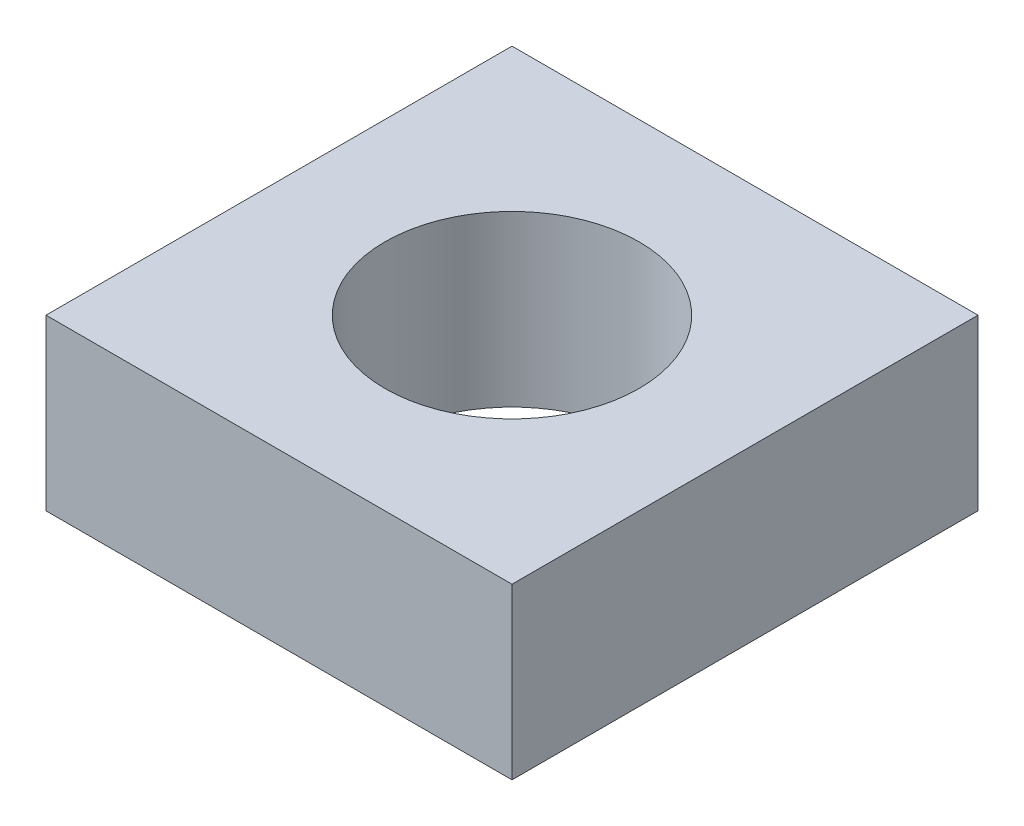
ISO-10303-21;
HEADER;
FILE_DESCRIPTION(('STEP AP214'),'2;1');
FILE_NAME('part.step','',(''),(''),'','','');
FILE_SCHEMA(('AUTOMOTIVE_DESIGN { 1 0 10303 214 1 1 1 1 }'));
ENDSEC;
DATA;
#1=APPLICATION_CONTEXT('core data for automotive mechanical design processes');
#2=APPLICATION_PROTOCOL_DEFINITION('international standard','automotive_design',2000,#1);
#3=PRODUCT_CONTEXT('',#1,'mechanical');
#4=PRODUCT('Part','Part','',(#3));
#5=PRODUCT_RELATED_PRODUCT_CATEGORY('part','',(#4));
#6=PRODUCT_DEFINITION_FORMATION('','',#4);
#7=PRODUCT_DEFINITION_CONTEXT('part definition',#1,'design');
#8=PRODUCT_DEFINITION('design','',#6,#7);
#9=PRODUCT_DEFINITION_SHAPE('','',#8);
#10=(LENGTH_UNIT() NAMED_UNIT(*) SI_UNIT(.MILLI.,.METRE.));
#11=(NAMED_UNIT(*) PLANE_ANGLE_UNIT() SI_UNIT($,.RADIAN.));
#12=(NAMED_UNIT(*) SI_UNIT($,.STERADIAN.) SOLID_ANGLE_UNIT());
#13=UNCERTAINTY_MEASURE_WITH_UNIT(LENGTH_MEASURE(1.E-05),#10,'distance_accuracy_value','');
#14=(GEOMETRIC_REPRESENTATION_CONTEXT(3) GLOBAL_UNCERTAINTY_ASSIGNED_CONTEXT((#13)) GLOBAL_UNIT_ASSIGNED_CONTEXT((#10,
#11,#12)) REPRESENTATION_CONTEXT('',''));
#15=CARTESIAN_POINT('',(0.,0.,0.));
#16=DIRECTION('',(0.,0.,1.));
#17=DIRECTION('',(1.,0.,0.));
#18=AXIS2_PLACEMENT_3D('',#15,#16,#17);
#19=CARTESIAN_POINT('',(2.75,2.,-2.75));
#20=DIRECTION('',(-1.,0.,0.));
#21=DIRECTION('',(0.,0.,1.));
#22=AXIS2_PLACEMENT_3D('',#19,#20,#21);
#23=PLANE('',#22);
#24=DIRECTION('',(0.,0.,-1.));
#25=VECTOR('',#24,1.);
#26=CARTESIAN_POINT('',(2.75,0.,-2.75));
#27=LINE('',#26,#25);
#28=CARTESIAN_POINT('',(2.75,0.,2.75));
#29=VERTEX_POINT('',#28);
#30=CARTESIAN_POINT('',(2.75,0.,-2.75));
#31=VERTEX_POINT('',#30);
#32=EDGE_CURVE('E107',#29,#31,#27,.T.);
#33=ORIENTED_EDGE('',*,*,#32,.T.);
#34=DIRECTION('',(0.,-1.,0.));
#35=VECTOR('',#34,1.);
#36=CARTESIAN_POINT('',(2.75,2.,-2.75));
#37=LINE('',#36,#35);
#38=CARTESIAN_POINT('',(2.75,2.,-2.75));
#39=VERTEX_POINT('',#38);
#40=EDGE_CURVE('E11',#39,#31,#37,.T.);
#41=ORIENTED_EDGE('',*,*,#40,.F.);
#42=DIRECTION('',(0.,0.,-1.));
#43=VECTOR('',#42,1.);
#44=CARTESIAN_POINT('',(2.75,2.,-2.75));
#45=LINE('',#44,#43);
#46=CARTESIAN_POINT('',(2.75,2.,2.75));
#47=VERTEX_POINT('',#46);
#48=EDGE_CURVE('E91',#47,#39,#45,.T.);
#49=ORIENTED_EDGE('',*,*,#48,.F.);
#50=DIRECTION('',(0.,-1.,0.));
#51=VECTOR('',#50,1.);
#52=CARTESIAN_POINT('',(2.75,2.,2.75));
#53=LINE('',#52,#51);
#54=EDGE_CURVE('E103',#47,#29,#53,.T.);
#55=ORIENTED_EDGE('',*,*,#54,.T.);
#56=EDGE_LOOP('',(#33,#41,#49,#55));
#57=FACE_BOUND('',#56,.T.);
#58=ADVANCED_FACE('F39',(#57),#23,.F.);
#59=CARTESIAN_POINT('',(-2.75,2.,-2.75));
#60=DIRECTION('',(0.,0.,1.));
#61=DIRECTION('',(1.,0.,0.));
#62=AXIS2_PLACEMENT_3D('',#59,#60,#61);
#63=PLANE('',#62);
#64=DIRECTION('',(-1.,0.,0.));
#65=VECTOR('',#64,1.);
#66=CARTESIAN_POINT('',(-2.75,0.,-2.75));
#67=LINE('',#66,#65);
#68=CARTESIAN_POINT('',(-2.75,0.,-2.75));
#69=VERTEX_POINT('',#68);
#70=EDGE_CURVE('E96',#31,#69,#67,.T.);
#71=ORIENTED_EDGE('',*,*,#70,.T.);
#72=DIRECTION('',(0.,-1.,0.));
#73=VECTOR('',#72,1.);
#74=CARTESIAN_POINT('',(-2.75,2.,-2.75));
#75=LINE('',#74,#73);
#76=CARTESIAN_POINT('',(-2.75,2.,-2.75));
#77=VERTEX_POINT('',#76);
#78=EDGE_CURVE('E48',#77,#69,#75,.T.);
#79=ORIENTED_EDGE('',*,*,#78,.F.);
#80=DIRECTION('',(-1.,0.,0.));
#81=VECTOR('',#80,1.);
#82=CARTESIAN_POINT('',(-2.75,2.,-2.75));
#83=LINE('',#82,#81);
#84=EDGE_CURVE('E86',#39,#77,#83,.T.);
#85=ORIENTED_EDGE('',*,*,#84,.F.);
#86=ORIENTED_EDGE('',*,*,#40,.T.);
#87=EDGE_LOOP('',(#71,#79,#85,#86));
#88=FACE_BOUND('',#87,.T.);
#89=ADVANCED_FACE('F95',(#88),#63,.F.);
#90=CARTESIAN_POINT('',(-2.75,2.,-2.75));
#91=DIRECTION('',(1.,0.,0.));
#92=DIRECTION('',(0.,0.,-1.));
#93=AXIS2_PLACEMENT_3D('',#90,#91,#92);
#94=PLANE('',#93);
#95=DIRECTION('',(0.,0.,1.));
#96=VECTOR('',#95,1.);
#97=CARTESIAN_POINT('',(-2.75,0.,-2.75));
#98=LINE('',#97,#96);
#99=CARTESIAN_POINT('',(-2.75,0.,2.75));
#100=VERTEX_POINT('',#99);
#101=EDGE_CURVE('E73',#69,#100,#98,.T.);
#102=ORIENTED_EDGE('',*,*,#101,.T.);
#103=DIRECTION('',(0.,-1.,0.));
#104=VECTOR('',#103,1.);
#105=CARTESIAN_POINT('',(-2.75,2.,2.75));
#106=LINE('',#105,#104);
#107=CARTESIAN_POINT('',(-2.75,2.,2.75));
#108=VERTEX_POINT('',#107);
#109=EDGE_CURVE('E98',#108,#100,#106,.T.);
#110=ORIENTED_EDGE('',*,*,#109,.F.);
#111=DIRECTION('',(0.,0.,1.));
#112=VECTOR('',#111,1.);
#113=CARTESIAN_POINT('',(-2.75,2.,-2.75));
#114=LINE('',#113,#112);
#115=EDGE_CURVE('E89',#77,#108,#114,.T.);
#116=ORIENTED_EDGE('',*,*,#115,.F.);
#117=ORIENTED_EDGE('',*,*,#78,.T.);
#118=EDGE_LOOP('',(#102,#110,#116,#117));
#119=FACE_BOUND('',#118,.T.);
#120=ADVANCED_FACE('F99',(#119),#94,.F.);
#121=CARTESIAN_POINT('',(-2.75,2.,2.75));
#122=DIRECTION('',(0.,0.,-1.));
#123=DIRECTION('',(-1.,0.,0.));
#124=AXIS2_PLACEMENT_3D('',#121,#122,#123);
#125=PLANE('',#124);
#126=DIRECTION('',(1.,0.,0.));
#127=VECTOR('',#126,1.);
#128=CARTESIAN_POINT('',(-2.75,0.,2.75));
#129=LINE('',#128,#127);
#130=EDGE_CURVE('E79',#100,#29,#129,.T.);
#131=ORIENTED_EDGE('',*,*,#130,.T.);
#132=ORIENTED_EDGE('',*,*,#54,.F.);
#133=DIRECTION('',(1.,0.,0.));
#134=VECTOR('',#133,1.);
#135=CARTESIAN_POINT('',(-2.75,2.,2.75));
#136=LINE('',#135,#134);
#137=EDGE_CURVE('E56',#108,#47,#136,.T.);
#138=ORIENTED_EDGE('',*,*,#137,.F.);
#139=ORIENTED_EDGE('',*,*,#109,.T.);
#140=EDGE_LOOP('',(#131,#132,#138,#139));
#141=FACE_BOUND('',#140,.T.);
#142=ADVANCED_FACE('F121',(#141),#125,.F.);
#143=CARTESIAN_POINT('',(0.,2.,0.));
#144=DIRECTION('',(0.,1.,0.));
#145=DIRECTION('',(0.,0.,1.));
#146=AXIS2_PLACEMENT_3D('',#143,#144,#145);
#147=PLANE('',#146);
#148=CARTESIAN_POINT('',(0.,2.,0.));
#149=DIRECTION('',(0.,1.,0.));
#150=DIRECTION('',(0.,0.,1.));
#151=AXIS2_PLACEMENT_3D('',#148,#149,#150);
#152=CIRCLE('',#151,1.5);
#153=CARTESIAN_POINT('',(0.,2.,1.5));
#154=VERTEX_POINT('',#153);
#155=EDGE_CURVE('E128',#154,#154,#152,.T.);
#156=ORIENTED_EDGE('',*,*,#155,.F.);
#157=EDGE_LOOP('',(#156));
#158=FACE_BOUND('',#157,.T.);
#159=ORIENTED_EDGE('',*,*,#48,.T.);
#160=ORIENTED_EDGE('',*,*,#84,.T.);
#161=ORIENTED_EDGE('',*,*,#115,.T.);
#162=ORIENTED_EDGE('',*,*,#137,.T.);
#163=EDGE_LOOP('',(#159,#160,#161,#162));
#164=FACE_BOUND('',#163,.T.);
#165=ADVANCED_FACE('F87',(#158,#164),#147,.T.);
#166=CARTESIAN_POINT('',(0.,0.,0.));
#167=DIRECTION('',(0.,1.,0.));
#168=DIRECTION('',(0.,0.,1.));
#169=AXIS2_PLACEMENT_3D('',#166,#167,#168);
#170=PLANE('',#169);
#171=CARTESIAN_POINT('',(0.,0.,0.));
#172=DIRECTION('',(0.,1.,0.));
#173=DIRECTION('',(0.,0.,1.));
#174=AXIS2_PLACEMENT_3D('',#171,#172,#173);
#175=CIRCLE('',#174,1.5);
#176=CARTESIAN_POINT('',(0.,0.,1.5));
#177=VERTEX_POINT('',#176);
#178=EDGE_CURVE('E111',#177,#177,#175,.T.);
#179=ORIENTED_EDGE('',*,*,#178,.T.);
#180=EDGE_LOOP('',(#179));
#181=FACE_BOUND('',#180,.T.);
#182=ORIENTED_EDGE('',*,*,#32,.F.);
#183=ORIENTED_EDGE('',*,*,#130,.F.);
#184=ORIENTED_EDGE('',*,*,#101,.F.);
#185=ORIENTED_EDGE('',*,*,#70,.F.);
#186=EDGE_LOOP('',(#182,#183,#184,#185));
#187=FACE_BOUND('',#186,.T.);
#188=ADVANCED_FACE('F124',(#181,#187),#170,.F.);
#189=CARTESIAN_POINT('',(0.,0.,0.));
#190=DIRECTION('',(0.,1.,0.));
#191=DIRECTION('',(0.,0.,1.));
#192=AXIS2_PLACEMENT_3D('',#189,#190,#191);
#193=CYLINDRICAL_SURFACE('',#192,1.5);
#194=ORIENTED_EDGE('',*,*,#178,.F.);
#195=EDGE_LOOP('',(#194));
#196=FACE_BOUND('',#195,.T.);
#197=ORIENTED_EDGE('',*,*,#155,.T.);
#198=EDGE_LOOP('',(#197));
#199=FACE_BOUND('',#198,.T.);
#200=ADVANCED_FACE('F137',(#196,#199),#193,.F.);
#201=CLOSED_SHELL('',(#58,#89,#120,#142,#165,#188,#200));
#202=MANIFOLD_SOLID_BREP('B2',#201);
#203=ADVANCED_BREP_SHAPE_REPRESENTATION('',(#18,#202),#14);
#204=SHAPE_DEFINITION_REPRESENTATION(#9,#203);
ENDSEC;
END-ISO-10303-21;
